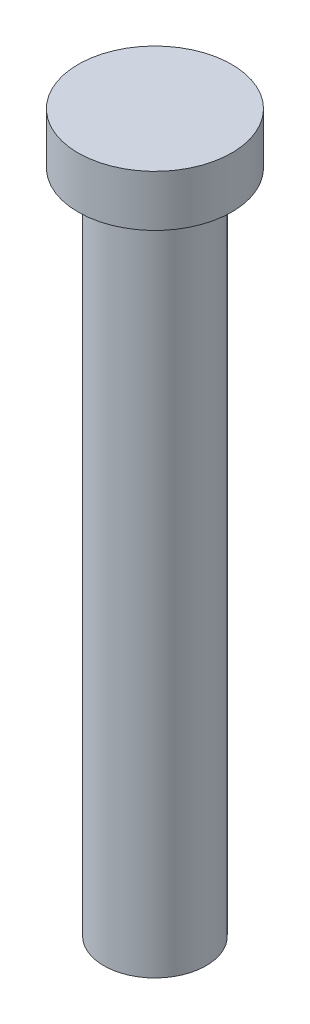
ISO-10303-21;
HEADER;
FILE_DESCRIPTION(('STEP AP214'),'2;1');
FILE_NAME('part.step','',(''),(''),'','','');
FILE_SCHEMA(('AUTOMOTIVE_DESIGN { 1 0 10303 214 1 1 1 1 }'));
ENDSEC;
DATA;
#1=APPLICATION_CONTEXT('core data for automotive mechanical design processes');
#2=APPLICATION_PROTOCOL_DEFINITION('international standard','automotive_design',2000,#1);
#3=PRODUCT_CONTEXT('',#1,'mechanical');
#4=PRODUCT('Part','Part','',(#3));
#5=PRODUCT_RELATED_PRODUCT_CATEGORY('part','',(#4));
#6=PRODUCT_DEFINITION_FORMATION('','',#4);
#7=PRODUCT_DEFINITION_CONTEXT('part definition',#1,'design');
#8=PRODUCT_DEFINITION('design','',#6,#7);
#9=PRODUCT_DEFINITION_SHAPE('','',#8);
#10=(LENGTH_UNIT() NAMED_UNIT(*) SI_UNIT(.MILLI.,.METRE.));
#11=(NAMED_UNIT(*) PLANE_ANGLE_UNIT() SI_UNIT($,.RADIAN.));
#12=(NAMED_UNIT(*) SI_UNIT($,.STERADIAN.) SOLID_ANGLE_UNIT());
#13=UNCERTAINTY_MEASURE_WITH_UNIT(LENGTH_MEASURE(1.E-05),#10,'distance_accuracy_value','');
#14=(GEOMETRIC_REPRESENTATION_CONTEXT(3) GLOBAL_UNCERTAINTY_ASSIGNED_CONTEXT((#13)) GLOBAL_UNIT_ASSIGNED_CONTEXT((#10,
#11,#12)) REPRESENTATION_CONTEXT('',''));
#15=CARTESIAN_POINT('',(0.,0.,0.));
#16=DIRECTION('',(0.,0.,1.));
#17=DIRECTION('',(1.,0.,0.));
#18=AXIS2_PLACEMENT_3D('',#15,#16,#17);
#19=CARTESIAN_POINT('',(0.,1.27,0.));
#20=DIRECTION('',(0.,-1.,0.));
#21=DIRECTION('',(0.,0.,-1.));
#22=AXIS2_PLACEMENT_3D('',#19,#20,#21);
#23=CYLINDRICAL_SURFACE('',#22,1.905);
#24=CARTESIAN_POINT('',(0.,1.27,0.));
#25=DIRECTION('',(0.,1.,0.));
#26=DIRECTION('',(0.,0.,1.));
#27=AXIS2_PLACEMENT_3D('',#24,#25,#26);
#28=CIRCLE('',#27,1.905);
#29=CARTESIAN_POINT('',(0.,1.27,1.905));
#30=VERTEX_POINT('',#29);
#31=EDGE_CURVE('E41',#30,#30,#28,.T.);
#32=ORIENTED_EDGE('',*,*,#31,.F.);
#33=EDGE_LOOP('',(#32));
#34=FACE_BOUND('',#33,.T.);
#35=CARTESIAN_POINT('',(0.,0.,0.));
#36=DIRECTION('',(0.,1.,0.));
#37=DIRECTION('',(0.,0.,1.));
#38=AXIS2_PLACEMENT_3D('',#35,#36,#37);
#39=CIRCLE('',#38,1.905);
#40=CARTESIAN_POINT('',(0.,0.,1.905));
#41=VERTEX_POINT('',#40);
#42=EDGE_CURVE('E37',#41,#41,#39,.T.);
#43=ORIENTED_EDGE('',*,*,#42,.T.);
#44=EDGE_LOOP('',(#43));
#45=FACE_BOUND('',#44,.T.);
#46=ADVANCED_FACE('F34',(#34,#45),#23,.T.);
#47=CARTESIAN_POINT('',(0.,1.27,0.));
#48=DIRECTION('',(0.,1.,0.));
#49=DIRECTION('',(0.,0.,1.));
#50=AXIS2_PLACEMENT_3D('',#47,#48,#49);
#51=PLANE('',#50);
#52=ORIENTED_EDGE('',*,*,#31,.T.);
#53=EDGE_LOOP('',(#52));
#54=FACE_BOUND('',#53,.T.);
#55=ADVANCED_FACE('F58',(#54),#51,.T.);
#56=CARTESIAN_POINT('',(0.,0.,0.));
#57=DIRECTION('',(0.,1.,0.));
#58=DIRECTION('',(0.,0.,1.));
#59=AXIS2_PLACEMENT_3D('',#56,#57,#58);
#60=PLANE('',#59);
#61=CARTESIAN_POINT('',(0.,0.,0.));
#62=DIRECTION('',(0.,-1.,0.));
#63=DIRECTION('',(0.,0.,-1.));
#64=AXIS2_PLACEMENT_3D('',#61,#62,#63);
#65=CIRCLE('',#64,1.27);
#66=CARTESIAN_POINT('',(0.,0.,-1.27));
#67=VERTEX_POINT('',#66);
#68=EDGE_CURVE('E10',#67,#67,#65,.T.);
#69=ORIENTED_EDGE('',*,*,#68,.F.);
#70=EDGE_LOOP('',(#69));
#71=FACE_BOUND('',#70,.T.);
#72=ORIENTED_EDGE('',*,*,#42,.F.);
#73=EDGE_LOOP('',(#72));
#74=FACE_BOUND('',#73,.T.);
#75=ADVANCED_FACE('F55',(#71,#74),#60,.F.);
#76=CARTESIAN_POINT('',(0.,-16.51,0.));
#77=DIRECTION('',(0.,1.,0.));
#78=DIRECTION('',(0.,0.,1.));
#79=AXIS2_PLACEMENT_3D('',#76,#77,#78);
#80=CYLINDRICAL_SURFACE('',#79,1.27);
#81=CARTESIAN_POINT('',(0.,-16.51,0.));
#82=DIRECTION('',(0.,-1.,0.));
#83=DIRECTION('',(0.,0.,-1.));
#84=AXIS2_PLACEMENT_3D('',#81,#82,#83);
#85=CIRCLE('',#84,1.27);
#86=CARTESIAN_POINT('',(0.,-16.51,-1.27));
#87=VERTEX_POINT('',#86);
#88=EDGE_CURVE('E47',#87,#87,#85,.T.);
#89=ORIENTED_EDGE('',*,*,#88,.F.);
#90=EDGE_LOOP('',(#89));
#91=FACE_BOUND('',#90,.T.);
#92=ORIENTED_EDGE('',*,*,#68,.T.);
#93=EDGE_LOOP('',(#92));
#94=FACE_BOUND('',#93,.T.);
#95=ADVANCED_FACE('F57',(#91,#94),#80,.T.);
#96=CARTESIAN_POINT('',(0.,-16.51,0.));
#97=DIRECTION('',(0.,-1.,0.));
#98=DIRECTION('',(0.,0.,-1.));
#99=AXIS2_PLACEMENT_3D('',#96,#97,#98);
#100=PLANE('',#99);
#101=ORIENTED_EDGE('',*,*,#88,.T.);
#102=EDGE_LOOP('',(#101));
#103=FACE_BOUND('',#102,.T.);
#104=ADVANCED_FACE('F64',(#103),#100,.T.);
#105=CLOSED_SHELL('',(#46,#55,#75,#95,#104));
#106=MANIFOLD_SOLID_BREP('B2',#105);
#107=ADVANCED_BREP_SHAPE_REPRESENTATION('',(#18,#106),#14);
#108=SHAPE_DEFINITION_REPRESENTATION(#9,#107);
ENDSEC;
END-ISO-10303-21;
